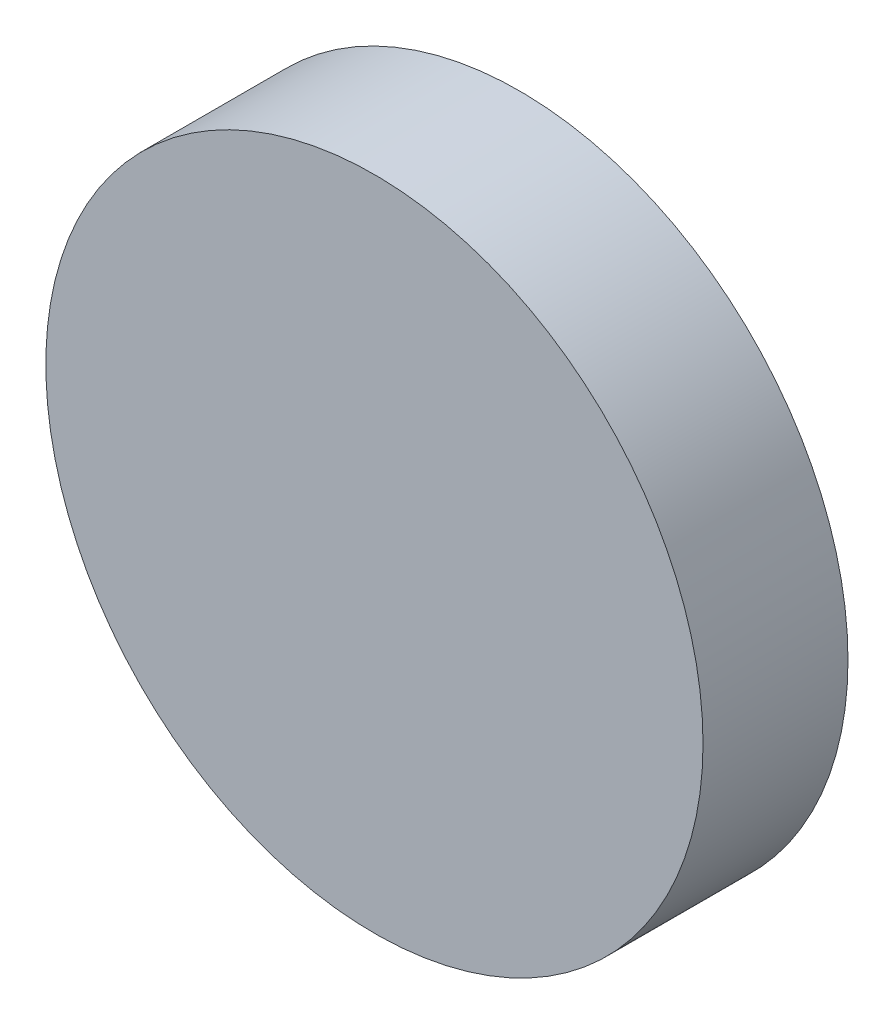
ISO-10303-21;
HEADER;
FILE_DESCRIPTION(('STEP AP214'),'2;1');
FILE_NAME('part.step','',(''),(''),'','','');
FILE_SCHEMA(('AUTOMOTIVE_DESIGN { 1 0 10303 214 1 1 1 1 }'));
ENDSEC;
DATA;
#1=APPLICATION_CONTEXT('core data for automotive mechanical design processes');
#2=APPLICATION_PROTOCOL_DEFINITION('international standard','automotive_design',2000,#1);
#3=PRODUCT_CONTEXT('',#1,'mechanical');
#4=PRODUCT('Part','Part','',(#3));
#5=PRODUCT_RELATED_PRODUCT_CATEGORY('part','',(#4));
#6=PRODUCT_DEFINITION_FORMATION('','',#4);
#7=PRODUCT_DEFINITION_CONTEXT('part definition',#1,'design');
#8=PRODUCT_DEFINITION('design','',#6,#7);
#9=PRODUCT_DEFINITION_SHAPE('','',#8);
#10=(LENGTH_UNIT() NAMED_UNIT(*) SI_UNIT(.MILLI.,.METRE.));
#11=(NAMED_UNIT(*) PLANE_ANGLE_UNIT() SI_UNIT($,.RADIAN.));
#12=(NAMED_UNIT(*) SI_UNIT($,.STERADIAN.) SOLID_ANGLE_UNIT());
#13=UNCERTAINTY_MEASURE_WITH_UNIT(LENGTH_MEASURE(1.E-05),#10,'distance_accuracy_value','');
#14=(GEOMETRIC_REPRESENTATION_CONTEXT(3) GLOBAL_UNCERTAINTY_ASSIGNED_CONTEXT((#13)) GLOBAL_UNIT_ASSIGNED_CONTEXT((#10,
#11,#12)) REPRESENTATION_CONTEXT('',''));
#15=CARTESIAN_POINT('',(0.,0.,0.));
#16=DIRECTION('',(0.,0.,1.));
#17=DIRECTION('',(1.,0.,0.));
#18=AXIS2_PLACEMENT_3D('',#15,#16,#17);
#19=CARTESIAN_POINT('',(0.,0.,0.9));
#20=DIRECTION('',(0.,0.,-1.));
#21=DIRECTION('',(-1.,0.,0.));
#22=AXIS2_PLACEMENT_3D('',#19,#20,#21);
#23=CYLINDRICAL_SURFACE('',#22,2.04);
#24=CARTESIAN_POINT('',(0.,0.,0.9));
#25=DIRECTION('',(0.,0.,1.));
#26=DIRECTION('',(1.,0.,0.));
#27=AXIS2_PLACEMENT_3D('',#24,#25,#26);
#28=CIRCLE('',#27,2.04);
#29=CARTESIAN_POINT('',(2.04,0.,0.9));
#30=VERTEX_POINT('',#29);
#31=EDGE_CURVE('E10',#30,#30,#28,.T.);
#32=ORIENTED_EDGE('',*,*,#31,.F.);
#33=EDGE_LOOP('',(#32));
#34=FACE_BOUND('',#33,.T.);
#35=CARTESIAN_POINT('',(0.,0.,0.));
#36=DIRECTION('',(0.,0.,1.));
#37=DIRECTION('',(1.,0.,0.));
#38=AXIS2_PLACEMENT_3D('',#35,#36,#37);
#39=CIRCLE('',#38,2.04);
#40=CARTESIAN_POINT('',(2.04,0.,0.));
#41=VERTEX_POINT('',#40);
#42=EDGE_CURVE('E38',#41,#41,#39,.T.);
#43=ORIENTED_EDGE('',*,*,#42,.T.);
#44=EDGE_LOOP('',(#43));
#45=FACE_BOUND('',#44,.T.);
#46=ADVANCED_FACE('F35',(#34,#45),#23,.T.);
#47=CARTESIAN_POINT('',(0.,0.,0.9));
#48=DIRECTION('',(0.,0.,1.));
#49=DIRECTION('',(1.,0.,0.));
#50=AXIS2_PLACEMENT_3D('',#47,#48,#49);
#51=PLANE('',#50);
#52=ORIENTED_EDGE('',*,*,#31,.T.);
#53=EDGE_LOOP('',(#52));
#54=FACE_BOUND('',#53,.T.);
#55=ADVANCED_FACE('F50',(#54),#51,.T.);
#56=CARTESIAN_POINT('',(0.,0.,0.));
#57=DIRECTION('',(0.,0.,1.));
#58=DIRECTION('',(1.,0.,0.));
#59=AXIS2_PLACEMENT_3D('',#56,#57,#58);
#60=PLANE('',#59);
#61=ORIENTED_EDGE('',*,*,#42,.F.);
#62=EDGE_LOOP('',(#61));
#63=FACE_BOUND('',#62,.T.);
#64=ADVANCED_FACE('F48',(#63),#60,.F.);
#65=CLOSED_SHELL('',(#46,#55,#64));
#66=MANIFOLD_SOLID_BREP('B2',#65);
#67=ADVANCED_BREP_SHAPE_REPRESENTATION('',(#18,#66),#14);
#68=SHAPE_DEFINITION_REPRESENTATION(#9,#67);
ENDSEC;
END-ISO-10303-21;
